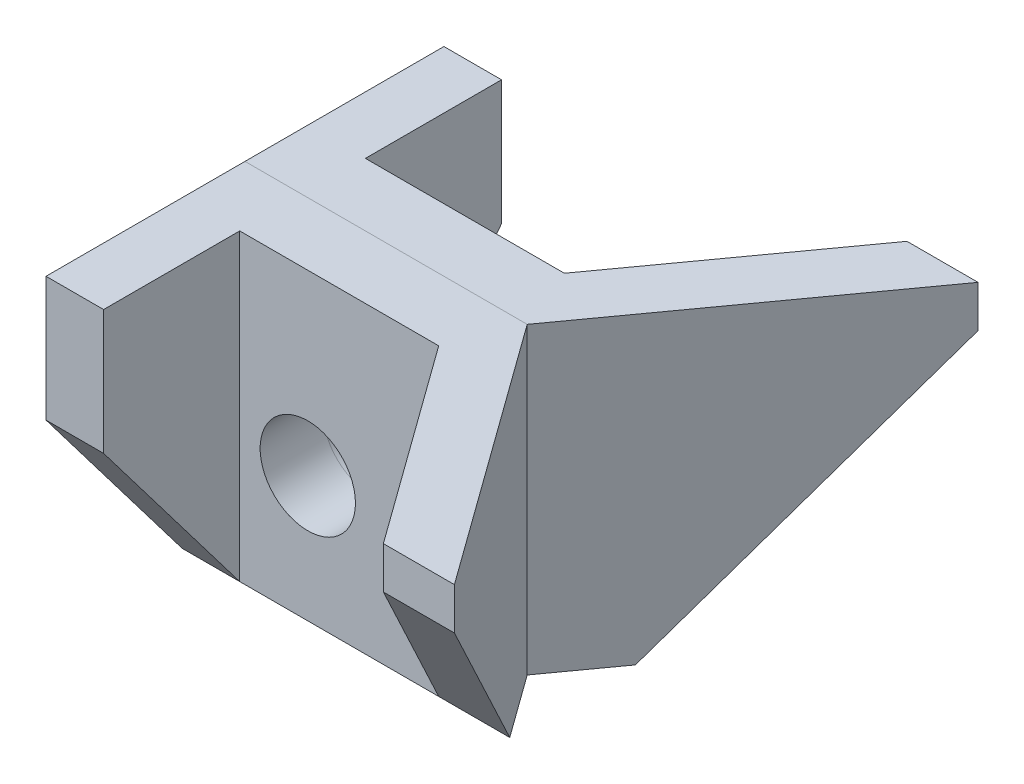
ISO-10303-21;
HEADER;
FILE_DESCRIPTION(('STEP AP214'),'2;1');
FILE_NAME('part.step','',(''),(''),'','','');
FILE_SCHEMA(('AUTOMOTIVE_DESIGN { 1 0 10303 214 1 1 1 1 }'));
ENDSEC;
DATA;
#1=APPLICATION_CONTEXT('core data for automotive mechanical design processes');
#2=APPLICATION_PROTOCOL_DEFINITION('international standard','automotive_design',2000,#1);
#3=PRODUCT_CONTEXT('',#1,'mechanical');
#4=PRODUCT('Part','Part','',(#3));
#5=PRODUCT_RELATED_PRODUCT_CATEGORY('part','',(#4));
#6=PRODUCT_DEFINITION_FORMATION('','',#4);
#7=PRODUCT_DEFINITION_CONTEXT('part definition',#1,'design');
#8=PRODUCT_DEFINITION('design','',#6,#7);
#9=PRODUCT_DEFINITION_SHAPE('','',#8);
#10=(LENGTH_UNIT() NAMED_UNIT(*) SI_UNIT(.MILLI.,.METRE.));
#11=(NAMED_UNIT(*) PLANE_ANGLE_UNIT() SI_UNIT($,.RADIAN.));
#12=(NAMED_UNIT(*) SI_UNIT($,.STERADIAN.) SOLID_ANGLE_UNIT());
#13=UNCERTAINTY_MEASURE_WITH_UNIT(LENGTH_MEASURE(1.E-05),#10,'distance_accuracy_value','');
#14=(GEOMETRIC_REPRESENTATION_CONTEXT(3) GLOBAL_UNCERTAINTY_ASSIGNED_CONTEXT((#13)) GLOBAL_UNIT_ASSIGNED_CONTEXT((#10,
#11,#12)) REPRESENTATION_CONTEXT('',''));
#15=CARTESIAN_POINT('',(0.,0.,0.));
#16=DIRECTION('',(0.,0.,1.));
#17=DIRECTION('',(1.,0.,0.));
#18=AXIS2_PLACEMENT_3D('',#15,#16,#17);
#19=CARTESIAN_POINT('',(0.,-12.,25.));
#20=DIRECTION('',(0.,-1.,0.));
#21=DIRECTION('',(1.,0.,0.));
#22=AXIS2_PLACEMENT_3D('',#19,#20,#21);
#23=PLANE('',#22);
#24=DIRECTION('',(0.,0.,-1.));
#25=VECTOR('',#24,1.);
#26=CARTESIAN_POINT('',(-12.,-12.,25.));
#27=LINE('',#26,#25);
#28=CARTESIAN_POINT('',(-12.,-12.,6.));
#29=VERTEX_POINT('',#28);
#30=CARTESIAN_POINT('',(-12.,-12.,0.));
#31=VERTEX_POINT('',#30);
#32=EDGE_CURVE('E13',#29,#31,#27,.T.);
#33=ORIENTED_EDGE('',*,*,#32,.T.);
#34=DIRECTION('',(1.,0.,0.));
#35=VECTOR('',#34,1.);
#36=CARTESIAN_POINT('',(0.,-12.,0.));
#37=LINE('',#36,#35);
#38=CARTESIAN_POINT('',(14.9519339128112,-12.,0.));
#39=VERTEX_POINT('',#38);
#40=EDGE_CURVE('E172',#31,#39,#37,.T.);
#41=ORIENTED_EDGE('',*,*,#40,.T.);
#42=DIRECTION('',(-0.585330910525227,0.,-0.810794502438015));
#43=VECTOR('',#42,1.);
#44=CARTESIAN_POINT('',(9.82921782204009,-12.,-7.09593491350215));
#45=LINE('',#44,#43);
#46=CARTESIAN_POINT('',(19.2834697737365,-12.,6.));
#47=VERTEX_POINT('',#46);
#48=EDGE_CURVE('E153',#47,#39,#45,.T.);
#49=ORIENTED_EDGE('',*,*,#48,.F.);
#50=DIRECTION('',(1.,0.,0.));
#51=VECTOR('',#50,1.);
#52=CARTESIAN_POINT('',(-43.4006369362152,-12.,6.));
#53=LINE('',#52,#51);
#54=CARTESIAN_POINT('',(12.5,-12.,6.));
#55=VERTEX_POINT('',#54);
#56=EDGE_CURVE('E162',#55,#47,#53,.T.);
#57=ORIENTED_EDGE('',*,*,#56,.F.);
#58=DIRECTION('',(1.,0.,0.));
#59=VECTOR('',#58,1.);
#60=CARTESIAN_POINT('',(0.,-12.,6.));
#61=LINE('',#60,#59);
#62=CARTESIAN_POINT('',(-6.49999999999999,-12.,6.));
#63=VERTEX_POINT('',#62);
#64=EDGE_CURVE('E228',#63,#55,#61,.T.);
#65=ORIENTED_EDGE('',*,*,#64,.F.);
#66=EDGE_CURVE('E168',#29,#63,#53,.T.);
#67=ORIENTED_EDGE('',*,*,#66,.F.);
#68=EDGE_LOOP('',(#33,#41,#49,#57,#65,#67));
#69=FACE_BOUND('',#68,.T.);
#70=ADVANCED_FACE('F77',(#69),#23,.T.);
#71=CARTESIAN_POINT('',(-12.,-12.,25.));
#72=DIRECTION('',(-1.,0.,0.));
#73=DIRECTION('',(0.,0.,-1.));
#74=AXIS2_PLACEMENT_3D('',#71,#72,#73);
#75=PLANE('',#74);
#76=DIRECTION('',(0.,1.,0.));
#77=VECTOR('',#76,1.);
#78=CARTESIAN_POINT('',(-12.,-12.,19.));
#79=LINE('',#78,#77);
#80=CARTESIAN_POINT('',(-12.,5.10526315789474,19.));
#81=VERTEX_POINT('',#80);
#82=CARTESIAN_POINT('',(-12.,17.,19.));
#83=VERTEX_POINT('',#82);
#84=EDGE_CURVE('E203',#81,#83,#79,.T.);
#85=ORIENTED_EDGE('',*,*,#84,.T.);
#86=DIRECTION('',(0.,0.,-1.));
#87=VECTOR('',#86,1.);
#88=CARTESIAN_POINT('',(-12.,17.,25.));
#89=LINE('',#88,#87);
#90=CARTESIAN_POINT('',(-12.,17.,0.));
#91=VERTEX_POINT('',#90);
#92=EDGE_CURVE('E86',#83,#91,#89,.T.);
#93=ORIENTED_EDGE('',*,*,#92,.T.);
#94=DIRECTION('',(0.,-1.,0.));
#95=VECTOR('',#94,1.);
#96=CARTESIAN_POINT('',(-12.,-12.,0.));
#97=LINE('',#96,#95);
#98=EDGE_CURVE('E193',#91,#31,#97,.T.);
#99=ORIENTED_EDGE('',*,*,#98,.T.);
#100=ORIENTED_EDGE('',*,*,#32,.F.);
#101=DIRECTION('',(0.,0.796162194123103,0.605083267533558));
#102=VECTOR('',#101,1.);
#103=CARTESIAN_POINT('',(-12.,-7.28397565922921,9.5841784989858));
#104=LINE('',#103,#102);
#105=EDGE_CURVE('E158',#29,#81,#104,.T.);
#106=ORIENTED_EDGE('',*,*,#105,.T.);
#107=EDGE_LOOP('',(#85,#93,#99,#100,#106));
#108=FACE_BOUND('',#107,.T.);
#109=ADVANCED_FACE('F199',(#108),#75,.T.);
#110=CARTESIAN_POINT('',(0.,0.,25.));
#111=DIRECTION('',(0.,0.,-1.));
#112=DIRECTION('',(1.,0.,0.));
#113=AXIS2_PLACEMENT_3D('',#110,#111,#112);
#114=PLANE('',#113);
#115=DIRECTION('',(1.,0.,0.));
#116=VECTOR('',#115,1.);
#117=CARTESIAN_POINT('',(-43.4006369362152,13.,25.));
#118=LINE('',#117,#116);
#119=CARTESIAN_POINT('',(26.2165302262635,13.,25.));
#120=VERTEX_POINT('',#119);
#121=CARTESIAN_POINT('',(33.,13.,25.));
#122=VERTEX_POINT('',#121);
#123=EDGE_CURVE('E169',#120,#122,#118,.T.);
#124=ORIENTED_EDGE('',*,*,#123,.T.);
#125=DIRECTION('',(0.,1.,0.));
#126=VECTOR('',#125,1.);
#127=CARTESIAN_POINT('',(33.,-12.,25.));
#128=LINE('',#127,#126);
#129=CARTESIAN_POINT('',(33.,17.,25.));
#130=VERTEX_POINT('',#129);
#131=EDGE_CURVE('E156',#122,#130,#128,.T.);
#132=ORIENTED_EDGE('',*,*,#131,.T.);
#133=DIRECTION('',(-1.,0.,0.));
#134=VECTOR('',#133,1.);
#135=CARTESIAN_POINT('',(33.,17.,25.));
#136=LINE('',#135,#134);
#137=CARTESIAN_POINT('',(26.2165302262635,17.,25.));
#138=VERTEX_POINT('',#137);
#139=EDGE_CURVE('E189',#130,#138,#136,.T.);
#140=ORIENTED_EDGE('',*,*,#139,.T.);
#141=DIRECTION('',(0.,1.,0.));
#142=VECTOR('',#141,1.);
#143=CARTESIAN_POINT('',(26.2165302262635,-12.,25.));
#144=LINE('',#143,#142);
#145=EDGE_CURVE('E219',#120,#138,#144,.T.);
#146=ORIENTED_EDGE('',*,*,#145,.F.);
#147=EDGE_LOOP('',(#124,#132,#140,#146));
#148=FACE_BOUND('',#147,.T.);
#149=ADVANCED_FACE('F242',(#148),#114,.F.);
#150=CARTESIAN_POINT('',(-6.49999999999999,-12.,0.));
#151=DIRECTION('',(-1.,0.,0.));
#152=DIRECTION('',(0.,-1.,0.));
#153=AXIS2_PLACEMENT_3D('',#150,#151,#152);
#154=PLANE('',#153);
#155=DIRECTION('',(0.,-0.796162194123103,-0.605083267533558));
#156=VECTOR('',#155,1.);
#157=CARTESIAN_POINT('',(-6.49999999999999,-14.8904665314402,3.80324543610548));
#158=LINE('',#157,#156);
#159=CARTESIAN_POINT('',(-6.49999999999999,5.10526315789474,19.));
#160=VERTEX_POINT('',#159);
#161=EDGE_CURVE('E234',#160,#63,#158,.T.);
#162=ORIENTED_EDGE('',*,*,#161,.T.);
#163=DIRECTION('',(0.,1.,0.));
#164=VECTOR('',#163,1.);
#165=CARTESIAN_POINT('',(-6.49999999999999,-12.,6.));
#166=LINE('',#165,#164);
#167=CARTESIAN_POINT('',(-6.5,17.,6.));
#168=VERTEX_POINT('',#167);
#169=EDGE_CURVE('E178',#63,#168,#166,.T.);
#170=ORIENTED_EDGE('',*,*,#169,.T.);
#171=DIRECTION('',(0.,0.,-1.));
#172=VECTOR('',#171,1.);
#173=CARTESIAN_POINT('',(-6.5,17.,0.));
#174=LINE('',#173,#172);
#175=CARTESIAN_POINT('',(-6.5,17.,19.));
#176=VERTEX_POINT('',#175);
#177=EDGE_CURVE('E226',#176,#168,#174,.T.);
#178=ORIENTED_EDGE('',*,*,#177,.F.);
#179=DIRECTION('',(0.,1.,0.));
#180=VECTOR('',#179,1.);
#181=CARTESIAN_POINT('',(-6.49999999999999,-12.,19.));
#182=LINE('',#181,#180);
#183=EDGE_CURVE('E218',#160,#176,#182,.T.);
#184=ORIENTED_EDGE('',*,*,#183,.F.);
#185=EDGE_LOOP('',(#162,#170,#178,#184));
#186=FACE_BOUND('',#185,.T.);
#187=ADVANCED_FACE('F252',(#186),#154,.F.);
#188=CARTESIAN_POINT('',(0.,-12.,19.));
#189=DIRECTION('',(0.,0.,-1.));
#190=DIRECTION('',(1.,0.,0.));
#191=AXIS2_PLACEMENT_3D('',#188,#189,#190);
#192=PLANE('',#191);
#193=DIRECTION('',(1.,0.,0.));
#194=VECTOR('',#193,1.);
#195=CARTESIAN_POINT('',(0.,5.10526315789474,19.));
#196=LINE('',#195,#194);
#197=EDGE_CURVE('E94',#81,#160,#196,.T.);
#198=ORIENTED_EDGE('',*,*,#197,.T.);
#199=ORIENTED_EDGE('',*,*,#183,.T.);
#200=DIRECTION('',(1.,0.,0.));
#201=VECTOR('',#200,1.);
#202=CARTESIAN_POINT('',(0.,17.,19.));
#203=LINE('',#202,#201);
#204=EDGE_CURVE('E206',#83,#176,#203,.T.);
#205=ORIENTED_EDGE('',*,*,#204,.F.);
#206=ORIENTED_EDGE('',*,*,#84,.F.);
#207=EDGE_LOOP('',(#198,#199,#205,#206));
#208=FACE_BOUND('',#207,.T.);
#209=ADVANCED_FACE('F216',(#208),#192,.F.);
#210=CARTESIAN_POINT('',(5.36984805863102,-12.,-3.8766149056134));
#211=DIRECTION('',(0.810794502438015,0.,-0.585330910525227));
#212=DIRECTION('',(0.585330910525227,0.,0.810794502438015));
#213=AXIS2_PLACEMENT_3D('',#210,#211,#212);
#214=PLANE('',#213);
#215=DIRECTION('',(0.400298286387528,0.72959101132782,0.554489168609143));
#216=VECTOR('',#215,1.);
#217=CARTESIAN_POINT('',(9.16524963985201,-18.0779772747536,1.38073727118729));
#218=LINE('',#217,#216);
#219=EDGE_CURVE('E164',#55,#120,#218,.T.);
#220=ORIENTED_EDGE('',*,*,#219,.T.);
#221=ORIENTED_EDGE('',*,*,#145,.T.);
#222=DIRECTION('',(0.585330910525227,0.,0.810794502438015));
#223=VECTOR('',#222,1.);
#224=CARTESIAN_POINT('',(5.36984805863101,17.,-3.8766149056134));
#225=LINE('',#224,#223);
#226=CARTESIAN_POINT('',(12.5,17.,6.));
#227=VERTEX_POINT('',#226);
#228=EDGE_CURVE('E230',#227,#138,#225,.T.);
#229=ORIENTED_EDGE('',*,*,#228,.F.);
#230=DIRECTION('',(0.,1.,0.));
#231=VECTOR('',#230,1.);
#232=CARTESIAN_POINT('',(12.5,-12.,6.));
#233=LINE('',#232,#231);
#234=EDGE_CURVE('E181',#55,#227,#233,.T.);
#235=ORIENTED_EDGE('',*,*,#234,.F.);
#236=EDGE_LOOP('',(#220,#221,#229,#235));
#237=FACE_BOUND('',#236,.T.);
#238=ADVANCED_FACE('F245',(#237),#214,.F.);
#239=CARTESIAN_POINT('',(9.82921782204009,-12.,-7.09593491350215));
#240=DIRECTION('',(-0.810794502438015,0.,0.585330910525227));
#241=DIRECTION('',(-0.585330910525227,0.,-0.810794502438015));
#242=AXIS2_PLACEMENT_3D('',#239,#240,#241);
#243=PLANE('',#242);
#244=DIRECTION('',(-0.400298286387528,-0.72959101132782,-0.554489168609143));
#245=VECTOR('',#244,1.);
#246=CARTESIAN_POINT('',(28.1739913433061,4.20402795552962,18.3150612462025));
#247=LINE('',#246,#245);
#248=EDGE_CURVE('E102',#122,#47,#247,.T.);
#249=ORIENTED_EDGE('',*,*,#248,.T.);
#250=ORIENTED_EDGE('',*,*,#48,.T.);
#251=DIRECTION('',(0.,1.,0.));
#252=VECTOR('',#251,1.);
#253=CARTESIAN_POINT('',(14.9519339128112,-12.,0.));
#254=LINE('',#253,#252);
#255=CARTESIAN_POINT('',(14.9519339128112,17.,0.));
#256=VERTEX_POINT('',#255);
#257=EDGE_CURVE('E173',#39,#256,#254,.T.);
#258=ORIENTED_EDGE('',*,*,#257,.T.);
#259=DIRECTION('',(-0.585330910525227,0.,-0.810794502438015));
#260=VECTOR('',#259,1.);
#261=CARTESIAN_POINT('',(9.82921782204009,17.,-7.09593491350215));
#262=LINE('',#261,#260);
#263=EDGE_CURVE('E174',#130,#256,#262,.T.);
#264=ORIENTED_EDGE('',*,*,#263,.F.);
#265=ORIENTED_EDGE('',*,*,#131,.F.);
#266=EDGE_LOOP('',(#249,#250,#258,#264,#265));
#267=FACE_BOUND('',#266,.T.);
#268=ADVANCED_FACE('F150',(#267),#243,.F.);
#269=CARTESIAN_POINT('',(33.,17.,25.));
#270=DIRECTION('',(0.,1.,0.));
#271=DIRECTION('',(-1.,0.,0.));
#272=AXIS2_PLACEMENT_3D('',#269,#270,#271);
#273=PLANE('',#272);
#274=ORIENTED_EDGE('',*,*,#204,.T.);
#275=ORIENTED_EDGE('',*,*,#177,.T.);
#276=DIRECTION('',(1.,0.,0.));
#277=VECTOR('',#276,1.);
#278=CARTESIAN_POINT('',(0.,17.,6.));
#279=LINE('',#278,#277);
#280=EDGE_CURVE('E232',#168,#227,#279,.T.);
#281=ORIENTED_EDGE('',*,*,#280,.T.);
#282=ORIENTED_EDGE('',*,*,#228,.T.);
#283=ORIENTED_EDGE('',*,*,#139,.F.);
#284=ORIENTED_EDGE('',*,*,#263,.T.);
#285=DIRECTION('',(-1.,0.,0.));
#286=VECTOR('',#285,1.);
#287=CARTESIAN_POINT('',(33.,17.,0.));
#288=LINE('',#287,#286);
#289=EDGE_CURVE('E187',#256,#91,#288,.T.);
#290=ORIENTED_EDGE('',*,*,#289,.T.);
#291=ORIENTED_EDGE('',*,*,#92,.F.);
#292=EDGE_LOOP('',(#274,#275,#281,#282,#283,#284,#290,#291));
#293=FACE_BOUND('',#292,.T.);
#294=ADVANCED_FACE('F79',(#293),#273,.T.);
#295=CARTESIAN_POINT('',(0.,0.,0.));
#296=DIRECTION('',(0.,0.,-1.));
#297=DIRECTION('',(1.,0.,0.));
#298=AXIS2_PLACEMENT_3D('',#295,#296,#297);
#299=PLANE('',#298);
#300=ORIENTED_EDGE('',*,*,#257,.F.);
#301=ORIENTED_EDGE('',*,*,#40,.F.);
#302=ORIENTED_EDGE('',*,*,#98,.F.);
#303=ORIENTED_EDGE('',*,*,#289,.F.);
#304=EDGE_LOOP('',(#300,#301,#302,#303));
#305=FACE_BOUND('',#304,.T.);
#306=CARTESIAN_POINT('',(0.,0.,0.));
#307=DIRECTION('',(0.,0.,1.));
#308=DIRECTION('',(1.,0.,0.));
#309=AXIS2_PLACEMENT_3D('',#306,#307,#308);
#310=CIRCLE('',#309,4.55);
#311=CARTESIAN_POINT('',(4.55,0.,0.));
#312=VERTEX_POINT('',#311);
#313=EDGE_CURVE('E184',#312,#312,#310,.T.);
#314=ORIENTED_EDGE('',*,*,#313,.T.);
#315=EDGE_LOOP('',(#314));
#316=FACE_BOUND('',#315,.T.);
#317=ADVANCED_FACE('F210',(#305,#316),#299,.T.);
#318=CARTESIAN_POINT('',(0.,0.,25.));
#319=DIRECTION('',(0.,0.,-1.));
#320=DIRECTION('',(1.,0.,0.));
#321=AXIS2_PLACEMENT_3D('',#318,#319,#320);
#322=CYLINDRICAL_SURFACE('',#321,4.55);
#323=CARTESIAN_POINT('',(0.,0.,6.));
#324=DIRECTION('',(0.,0.,1.));
#325=DIRECTION('',(1.,0.,0.));
#326=AXIS2_PLACEMENT_3D('',#323,#324,#325);
#327=CIRCLE('',#326,4.55);
#328=CARTESIAN_POINT('',(4.55,0.,6.));
#329=VERTEX_POINT('',#328);
#330=EDGE_CURVE('E81',#329,#329,#327,.F.);
#331=ORIENTED_EDGE('',*,*,#330,.F.);
#332=EDGE_LOOP('',(#331));
#333=FACE_BOUND('',#332,.T.);
#334=ORIENTED_EDGE('',*,*,#313,.F.);
#335=EDGE_LOOP('',(#334));
#336=FACE_BOUND('',#335,.T.);
#337=ADVANCED_FACE('F268',(#333,#336),#322,.F.);
#338=CARTESIAN_POINT('',(0.,-12.,6.));
#339=DIRECTION('',(0.,0.,-1.));
#340=DIRECTION('',(1.,0.,0.));
#341=AXIS2_PLACEMENT_3D('',#338,#339,#340);
#342=PLANE('',#341);
#343=ORIENTED_EDGE('',*,*,#280,.F.);
#344=ORIENTED_EDGE('',*,*,#169,.F.);
#345=ORIENTED_EDGE('',*,*,#64,.T.);
#346=ORIENTED_EDGE('',*,*,#234,.T.);
#347=EDGE_LOOP('',(#343,#344,#345,#346));
#348=FACE_BOUND('',#347,.T.);
#349=ORIENTED_EDGE('',*,*,#330,.T.);
#350=EDGE_LOOP('',(#349));
#351=FACE_BOUND('',#350,.T.);
#352=ADVANCED_FACE('F248',(#348,#351),#342,.F.);
#353=CARTESIAN_POINT('',(-43.4006369362152,-7.28397565922922,9.58417849898581));
#354=DIRECTION('',(0.,-0.605083267533558,0.796162194123103));
#355=DIRECTION('',(0.,0.796162194123103,0.605083267533558));
#356=AXIS2_PLACEMENT_3D('',#353,#354,#355);
#357=PLANE('',#356);
#358=ORIENTED_EDGE('',*,*,#219,.F.);
#359=ORIENTED_EDGE('',*,*,#56,.T.);
#360=ORIENTED_EDGE('',*,*,#248,.F.);
#361=ORIENTED_EDGE('',*,*,#123,.F.);
#362=EDGE_LOOP('',(#358,#359,#360,#361));
#363=FACE_BOUND('',#362,.T.);
#364=ADVANCED_FACE('F163',(#363),#357,.T.);
#365=ORIENTED_EDGE('',*,*,#161,.F.);
#366=ORIENTED_EDGE('',*,*,#197,.F.);
#367=ORIENTED_EDGE('',*,*,#105,.F.);
#368=ORIENTED_EDGE('',*,*,#66,.T.);
#369=EDGE_LOOP('',(#365,#366,#367,#368));
#370=FACE_BOUND('',#369,.T.);
#371=ADVANCED_FACE('F253',(#370),#357,.T.);
#372=CLOSED_SHELL('',(#70,#109,#149,#187,#209,#238,#268,#294,#317,#337,#352,#364,#371));
#373=MANIFOLD_SOLID_BREP('B2_NOT_SHOWN',#372);
#374=CARTESIAN_POINT('',(0.,-12.,-25.));
#375=DIRECTION('',(0.,-1.,0.));
#376=DIRECTION('',(1.,0.,0.));
#377=AXIS2_PLACEMENT_3D('',#374,#375,#376);
#378=PLANE('',#377);
#379=DIRECTION('',(0.,0.,1.));
#380=VECTOR('',#379,1.);
#381=CARTESIAN_POINT('',(-12.,-12.,-25.));
#382=LINE('',#381,#380);
#383=CARTESIAN_POINT('',(-12.,-12.,-6.));
#384=VERTEX_POINT('',#383);
#385=CARTESIAN_POINT('',(-12.,-12.,0.));
#386=VERTEX_POINT('',#385);
#387=EDGE_CURVE('E75',#384,#386,#382,.T.);
#388=ORIENTED_EDGE('',*,*,#387,.F.);
#389=DIRECTION('',(1.,0.,0.));
#390=VECTOR('',#389,1.);
#391=CARTESIAN_POINT('',(-43.4006369362152,-12.,-6.));
#392=LINE('',#391,#390);
#393=CARTESIAN_POINT('',(-6.49999999999999,-12.,-6.));
#394=VERTEX_POINT('',#393);
#395=EDGE_CURVE('E479',#384,#394,#392,.T.);
#396=ORIENTED_EDGE('',*,*,#395,.T.);
#397=DIRECTION('',(1.,0.,0.));
#398=VECTOR('',#397,1.);
#399=CARTESIAN_POINT('',(0.,-12.,-6.));
#400=LINE('',#399,#398);
#401=CARTESIAN_POINT('',(12.5,-12.,-6.));
#402=VERTEX_POINT('',#401);
#403=EDGE_CURVE('E478',#394,#402,#400,.T.);
#404=ORIENTED_EDGE('',*,*,#403,.T.);
#405=CARTESIAN_POINT('',(19.2834697737365,-12.,-6.));
#406=VERTEX_POINT('',#405);
#407=EDGE_CURVE('E464',#402,#406,#392,.T.);
#408=ORIENTED_EDGE('',*,*,#407,.T.);
#409=DIRECTION('',(-0.585330910525227,0.,0.810794502438015));
#410=VECTOR('',#409,1.);
#411=CARTESIAN_POINT('',(9.82921782204009,-12.,7.09593491350215));
#412=LINE('',#411,#410);
#413=CARTESIAN_POINT('',(14.9519339128112,-12.,0.));
#414=VERTEX_POINT('',#413);
#415=EDGE_CURVE('E474',#406,#414,#412,.T.);
#416=ORIENTED_EDGE('',*,*,#415,.T.);
#417=DIRECTION('',(1.,0.,0.));
#418=VECTOR('',#417,1.);
#419=CARTESIAN_POINT('',(0.,-12.,0.));
#420=LINE('',#419,#418);
#421=EDGE_CURVE('E501',#386,#414,#420,.T.);
#422=ORIENTED_EDGE('',*,*,#421,.F.);
#423=EDGE_LOOP('',(#388,#396,#404,#408,#416,#422));
#424=FACE_BOUND('',#423,.T.);
#425=ADVANCED_FACE('F392',(#424),#378,.T.);
#426=CARTESIAN_POINT('',(-12.,-12.,-25.));
#427=DIRECTION('',(-1.,0.,0.));
#428=DIRECTION('',(0.,0.,1.));
#429=AXIS2_PLACEMENT_3D('',#426,#427,#428);
#430=PLANE('',#429);
#431=DIRECTION('',(0.,1.,0.));
#432=VECTOR('',#431,1.);
#433=CARTESIAN_POINT('',(-12.,-12.,-19.));
#434=LINE('',#433,#432);
#435=CARTESIAN_POINT('',(-12.,5.10526315789474,-19.));
#436=VERTEX_POINT('',#435);
#437=CARTESIAN_POINT('',(-12.,17.,-19.));
#438=VERTEX_POINT('',#437);
#439=EDGE_CURVE('E554',#436,#438,#434,.T.);
#440=ORIENTED_EDGE('',*,*,#439,.F.);
#441=DIRECTION('',(0.,0.796162194123103,-0.605083267533558));
#442=VECTOR('',#441,1.);
#443=CARTESIAN_POINT('',(-12.,-7.28397565922921,-9.5841784989858));
#444=LINE('',#443,#442);
#445=EDGE_CURVE('E409',#384,#436,#444,.T.);
#446=ORIENTED_EDGE('',*,*,#445,.F.);
#447=ORIENTED_EDGE('',*,*,#387,.T.);
#448=DIRECTION('',(0.,-1.,0.));
#449=VECTOR('',#448,1.);
#450=CARTESIAN_POINT('',(-12.,-12.,0.));
#451=LINE('',#450,#449);
#452=CARTESIAN_POINT('',(-12.,17.,0.));
#453=VERTEX_POINT('',#452);
#454=EDGE_CURVE('E506',#453,#386,#451,.T.);
#455=ORIENTED_EDGE('',*,*,#454,.F.);
#456=DIRECTION('',(0.,0.,1.));
#457=VECTOR('',#456,1.);
#458=CARTESIAN_POINT('',(-12.,17.,-25.));
#459=LINE('',#458,#457);
#460=EDGE_CURVE('E401',#438,#453,#459,.T.);
#461=ORIENTED_EDGE('',*,*,#460,.F.);
#462=EDGE_LOOP('',(#440,#446,#447,#455,#461));
#463=FACE_BOUND('',#462,.T.);
#464=ADVANCED_FACE('F523',(#463),#430,.T.);
#465=CARTESIAN_POINT('',(0.,0.,-25.));
#466=DIRECTION('',(0.,0.,1.));
#467=DIRECTION('',(1.,0.,0.));
#468=AXIS2_PLACEMENT_3D('',#465,#466,#467);
#469=PLANE('',#468);
#470=DIRECTION('',(1.,0.,0.));
#471=VECTOR('',#470,1.);
#472=CARTESIAN_POINT('',(-43.4006369362152,13.,-25.));
#473=LINE('',#472,#471);
#474=CARTESIAN_POINT('',(26.2165302262635,13.,-25.));
#475=VERTEX_POINT('',#474);
#476=CARTESIAN_POINT('',(33.,13.,-25.));
#477=VERTEX_POINT('',#476);
#478=EDGE_CURVE('E417',#475,#477,#473,.T.);
#479=ORIENTED_EDGE('',*,*,#478,.F.);
#480=DIRECTION('',(0.,1.,0.));
#481=VECTOR('',#480,1.);
#482=CARTESIAN_POINT('',(26.2165302262635,-12.,-25.));
#483=LINE('',#482,#481);
#484=CARTESIAN_POINT('',(26.2165302262635,17.,-25.));
#485=VERTEX_POINT('',#484);
#486=EDGE_CURVE('E542',#475,#485,#483,.T.);
#487=ORIENTED_EDGE('',*,*,#486,.T.);
#488=DIRECTION('',(-1.,0.,0.));
#489=VECTOR('',#488,1.);
#490=CARTESIAN_POINT('',(33.,17.,-25.));
#491=LINE('',#490,#489);
#492=CARTESIAN_POINT('',(33.,17.,-25.));
#493=VERTEX_POINT('',#492);
#494=EDGE_CURVE('E500',#493,#485,#491,.T.);
#495=ORIENTED_EDGE('',*,*,#494,.F.);
#496=DIRECTION('',(0.,1.,0.));
#497=VECTOR('',#496,1.);
#498=CARTESIAN_POINT('',(33.,-12.,-25.));
#499=LINE('',#498,#497);
#500=EDGE_CURVE('E498',#477,#493,#499,.T.);
#501=ORIENTED_EDGE('',*,*,#500,.F.);
#502=EDGE_LOOP('',(#479,#487,#495,#501));
#503=FACE_BOUND('',#502,.T.);
#504=ADVANCED_FACE('F558',(#503),#469,.F.);
#505=CARTESIAN_POINT('',(-6.49999999999999,-12.,0.));
#506=DIRECTION('',(-1.,0.,0.));
#507=DIRECTION('',(0.,-1.,0.));
#508=AXIS2_PLACEMENT_3D('',#505,#506,#507);
#509=PLANE('',#508);
#510=DIRECTION('',(0.,-0.796162194123103,0.605083267533558));
#511=VECTOR('',#510,1.);
#512=CARTESIAN_POINT('',(-6.49999999999999,-14.8904665314402,-3.80324543610548));
#513=LINE('',#512,#511);
#514=CARTESIAN_POINT('',(-6.49999999999999,5.10526315789474,-19.));
#515=VERTEX_POINT('',#514);
#516=EDGE_CURVE('E530',#515,#394,#513,.T.);
#517=ORIENTED_EDGE('',*,*,#516,.F.);
#518=DIRECTION('',(0.,1.,0.));
#519=VECTOR('',#518,1.);
#520=CARTESIAN_POINT('',(-6.49999999999999,-12.,-19.));
#521=LINE('',#520,#519);
#522=CARTESIAN_POINT('',(-6.5,17.,-19.));
#523=VERTEX_POINT('',#522);
#524=EDGE_CURVE('E536',#515,#523,#521,.T.);
#525=ORIENTED_EDGE('',*,*,#524,.T.);
#526=DIRECTION('',(0.,0.,1.));
#527=VECTOR('',#526,1.);
#528=CARTESIAN_POINT('',(-6.5,17.,0.));
#529=LINE('',#528,#527);
#530=CARTESIAN_POINT('',(-6.5,17.,-6.));
#531=VERTEX_POINT('',#530);
#532=EDGE_CURVE('E532',#523,#531,#529,.T.);
#533=ORIENTED_EDGE('',*,*,#532,.T.);
#534=DIRECTION('',(0.,1.,0.));
#535=VECTOR('',#534,1.);
#536=CARTESIAN_POINT('',(-6.49999999999999,-12.,-6.));
#537=LINE('',#536,#535);
#538=EDGE_CURVE('E488',#394,#531,#537,.T.);
#539=ORIENTED_EDGE('',*,*,#538,.F.);
#540=EDGE_LOOP('',(#517,#525,#533,#539));
#541=FACE_BOUND('',#540,.T.);
#542=ADVANCED_FACE('F529',(#541),#509,.F.);
#543=CARTESIAN_POINT('',(0.,-12.,-19.));
#544=DIRECTION('',(0.,0.,1.));
#545=DIRECTION('',(1.,0.,0.));
#546=AXIS2_PLACEMENT_3D('',#543,#544,#545);
#547=PLANE('',#546);
#548=DIRECTION('',(1.,0.,0.));
#549=VECTOR('',#548,1.);
#550=CARTESIAN_POINT('',(0.,5.10526315789474,-19.));
#551=LINE('',#550,#549);
#552=EDGE_CURVE('E562',#436,#515,#551,.T.);
#553=ORIENTED_EDGE('',*,*,#552,.F.);
#554=ORIENTED_EDGE('',*,*,#439,.T.);
#555=DIRECTION('',(1.,0.,0.));
#556=VECTOR('',#555,1.);
#557=CARTESIAN_POINT('',(0.,17.,-19.));
#558=LINE('',#557,#556);
#559=EDGE_CURVE('E516',#438,#523,#558,.T.);
#560=ORIENTED_EDGE('',*,*,#559,.T.);
#561=ORIENTED_EDGE('',*,*,#524,.F.);
#562=EDGE_LOOP('',(#553,#554,#560,#561));
#563=FACE_BOUND('',#562,.T.);
#564=ADVANCED_FACE('F593',(#563),#547,.F.);
#565=CARTESIAN_POINT('',(5.36984805863102,-12.,3.8766149056134));
#566=DIRECTION('',(0.810794502438015,0.,0.585330910525227));
#567=DIRECTION('',(0.585330910525227,0.,-0.810794502438015));
#568=AXIS2_PLACEMENT_3D('',#565,#566,#567);
#569=PLANE('',#568);
#570=DIRECTION('',(0.400298286387528,0.72959101132782,-0.554489168609143));
#571=VECTOR('',#570,1.);
#572=CARTESIAN_POINT('',(9.16524963985201,-18.0779772747536,-1.38073727118729));
#573=LINE('',#572,#571);
#574=EDGE_CURVE('E525',#402,#475,#573,.T.);
#575=ORIENTED_EDGE('',*,*,#574,.F.);
#576=DIRECTION('',(0.,1.,0.));
#577=VECTOR('',#576,1.);
#578=CARTESIAN_POINT('',(12.5,-12.,-6.));
#579=LINE('',#578,#577);
#580=CARTESIAN_POINT('',(12.5,17.,-6.));
#581=VERTEX_POINT('',#580);
#582=EDGE_CURVE('E491',#402,#581,#579,.T.);
#583=ORIENTED_EDGE('',*,*,#582,.T.);
#584=DIRECTION('',(0.585330910525227,0.,-0.810794502438015));
#585=VECTOR('',#584,1.);
#586=CARTESIAN_POINT('',(5.36984805863101,17.,3.8766149056134));
#587=LINE('',#586,#585);
#588=EDGE_CURVE('E549',#581,#485,#587,.T.);
#589=ORIENTED_EDGE('',*,*,#588,.T.);
#590=ORIENTED_EDGE('',*,*,#486,.F.);
#591=EDGE_LOOP('',(#575,#583,#589,#590));
#592=FACE_BOUND('',#591,.T.);
#593=ADVANCED_FACE('F561',(#592),#569,.F.);
#594=CARTESIAN_POINT('',(9.82921782204009,-12.,7.09593491350215));
#595=DIRECTION('',(-0.810794502438015,0.,-0.585330910525227));
#596=DIRECTION('',(-0.585330910525227,0.,0.810794502438015));
#597=AXIS2_PLACEMENT_3D('',#594,#595,#596);
#598=PLANE('',#597);
#599=DIRECTION('',(-0.400298286387528,-0.72959101132782,0.554489168609143));
#600=VECTOR('',#599,1.);
#601=CARTESIAN_POINT('',(28.1739913433061,4.20402795552962,-18.3150612462025));
#602=LINE('',#601,#600);
#603=EDGE_CURVE('E461',#477,#406,#602,.T.);
#604=ORIENTED_EDGE('',*,*,#603,.F.);
#605=ORIENTED_EDGE('',*,*,#500,.T.);
#606=DIRECTION('',(-0.585330910525227,0.,0.810794502438015));
#607=VECTOR('',#606,1.);
#608=CARTESIAN_POINT('',(9.82921782204009,17.,7.09593491350215));
#609=LINE('',#608,#607);
#610=CARTESIAN_POINT('',(14.9519339128112,17.,0.));
#611=VERTEX_POINT('',#610);
#612=EDGE_CURVE('E485',#493,#611,#609,.T.);
#613=ORIENTED_EDGE('',*,*,#612,.T.);
#614=DIRECTION('',(0.,1.,0.));
#615=VECTOR('',#614,1.);
#616=CARTESIAN_POINT('',(14.9519339128112,-12.,0.));
#617=LINE('',#616,#615);
#618=EDGE_CURVE('E483',#414,#611,#617,.T.);
#619=ORIENTED_EDGE('',*,*,#618,.F.);
#620=ORIENTED_EDGE('',*,*,#415,.F.);
#621=EDGE_LOOP('',(#604,#605,#613,#619,#620));
#622=FACE_BOUND('',#621,.T.);
#623=ADVANCED_FACE('F481',(#622),#598,.F.);
#624=CARTESIAN_POINT('',(33.,17.,-25.));
#625=DIRECTION('',(0.,1.,0.));
#626=DIRECTION('',(-1.,0.,0.));
#627=AXIS2_PLACEMENT_3D('',#624,#625,#626);
#628=PLANE('',#627);
#629=ORIENTED_EDGE('',*,*,#559,.F.);
#630=ORIENTED_EDGE('',*,*,#460,.T.);
#631=DIRECTION('',(-1.,0.,0.));
#632=VECTOR('',#631,1.);
#633=CARTESIAN_POINT('',(33.,17.,0.));
#634=LINE('',#633,#632);
#635=EDGE_CURVE('E497',#611,#453,#634,.T.);
#636=ORIENTED_EDGE('',*,*,#635,.F.);
#637=ORIENTED_EDGE('',*,*,#612,.F.);
#638=ORIENTED_EDGE('',*,*,#494,.T.);
#639=ORIENTED_EDGE('',*,*,#588,.F.);
#640=DIRECTION('',(1.,0.,0.));
#641=VECTOR('',#640,1.);
#642=CARTESIAN_POINT('',(0.,17.,-6.));
#643=LINE('',#642,#641);
#644=EDGE_CURVE('E547',#531,#581,#643,.T.);
#645=ORIENTED_EDGE('',*,*,#644,.F.);
#646=ORIENTED_EDGE('',*,*,#532,.F.);
#647=EDGE_LOOP('',(#629,#630,#636,#637,#638,#639,#645,#646));
#648=FACE_BOUND('',#647,.T.);
#649=ADVANCED_FACE('F394',(#648),#628,.T.);
#650=CARTESIAN_POINT('',(0.,0.,0.));
#651=DIRECTION('',(0.,0.,1.));
#652=DIRECTION('',(1.,0.,0.));
#653=AXIS2_PLACEMENT_3D('',#650,#651,#652);
#654=PLANE('',#653);
#655=ORIENTED_EDGE('',*,*,#618,.T.);
#656=ORIENTED_EDGE('',*,*,#635,.T.);
#657=ORIENTED_EDGE('',*,*,#454,.T.);
#658=ORIENTED_EDGE('',*,*,#421,.T.);
#659=EDGE_LOOP('',(#655,#656,#657,#658));
#660=FACE_BOUND('',#659,.T.);
#661=CARTESIAN_POINT('',(0.,0.,0.));
#662=DIRECTION('',(0.,0.,1.));
#663=DIRECTION('',(1.,0.,0.));
#664=AXIS2_PLACEMENT_3D('',#661,#662,#663);
#665=CIRCLE('',#664,4.55);
#666=CARTESIAN_POINT('',(4.55,0.,0.));
#667=VERTEX_POINT('',#666);
#668=EDGE_CURVE('E494',#667,#667,#665,.T.);
#669=ORIENTED_EDGE('',*,*,#668,.F.);
#670=EDGE_LOOP('',(#669));
#671=FACE_BOUND('',#670,.T.);
#672=ADVANCED_FACE('F521',(#660,#671),#654,.T.);
#673=CARTESIAN_POINT('',(0.,0.,-25.));
#674=DIRECTION('',(0.,0.,1.));
#675=DIRECTION('',(1.,0.,0.));
#676=AXIS2_PLACEMENT_3D('',#673,#674,#675);
#677=CYLINDRICAL_SURFACE('',#676,4.55);
#678=CARTESIAN_POINT('',(0.,0.,-6.));
#679=DIRECTION('',(0.,0.,1.));
#680=DIRECTION('',(1.,0.,0.));
#681=AXIS2_PLACEMENT_3D('',#678,#679,#680);
#682=CIRCLE('',#681,4.55);
#683=CARTESIAN_POINT('',(4.55,0.,-6.));
#684=VERTEX_POINT('',#683);
#685=EDGE_CURVE('E396',#684,#684,#682,.F.);
#686=ORIENTED_EDGE('',*,*,#685,.T.);
#687=EDGE_LOOP('',(#686));
#688=FACE_BOUND('',#687,.T.);
#689=ORIENTED_EDGE('',*,*,#668,.T.);
#690=EDGE_LOOP('',(#689));
#691=FACE_BOUND('',#690,.T.);
#692=ADVANCED_FACE('F581',(#688,#691),#677,.F.);
#693=CARTESIAN_POINT('',(0.,-12.,-6.));
#694=DIRECTION('',(0.,0.,1.));
#695=DIRECTION('',(1.,0.,0.));
#696=AXIS2_PLACEMENT_3D('',#693,#694,#695);
#697=PLANE('',#696);
#698=ORIENTED_EDGE('',*,*,#644,.T.);
#699=ORIENTED_EDGE('',*,*,#582,.F.);
#700=ORIENTED_EDGE('',*,*,#403,.F.);
#701=ORIENTED_EDGE('',*,*,#538,.T.);
#702=EDGE_LOOP('',(#698,#699,#700,#701));
#703=FACE_BOUND('',#702,.T.);
#704=ORIENTED_EDGE('',*,*,#685,.F.);
#705=EDGE_LOOP('',(#704));
#706=FACE_BOUND('',#705,.T.);
#707=ADVANCED_FACE('F539',(#703,#706),#697,.F.);
#708=CARTESIAN_POINT('',(-43.4006369362152,-7.28397565922922,-9.58417849898581));
#709=DIRECTION('',(0.,-0.605083267533558,-0.796162194123103));
#710=DIRECTION('',(0.,0.796162194123103,-0.605083267533558));
#711=AXIS2_PLACEMENT_3D('',#708,#709,#710);
#712=PLANE('',#711);
#713=ORIENTED_EDGE('',*,*,#574,.T.);
#714=ORIENTED_EDGE('',*,*,#478,.T.);
#715=ORIENTED_EDGE('',*,*,#603,.T.);
#716=ORIENTED_EDGE('',*,*,#407,.F.);
#717=EDGE_LOOP('',(#713,#714,#715,#716));
#718=FACE_BOUND('',#717,.T.);
#719=ADVANCED_FACE('F463',(#718),#712,.T.);
#720=ORIENTED_EDGE('',*,*,#516,.T.);
#721=ORIENTED_EDGE('',*,*,#395,.F.);
#722=ORIENTED_EDGE('',*,*,#445,.T.);
#723=ORIENTED_EDGE('',*,*,#552,.T.);
#724=EDGE_LOOP('',(#720,#721,#722,#723));
#725=FACE_BOUND('',#724,.T.);
#726=ADVANCED_FACE('F566',(#725),#712,.T.);
#727=CLOSED_SHELL('',(#425,#464,#504,#542,#564,#593,#623,#649,#672,#692,#707,#719,#726));
#728=MANIFOLD_SOLID_BREP('B7',#727);
#729=ADVANCED_BREP_SHAPE_REPRESENTATION('',(#18,#373,#728),#14);
#730=SHAPE_DEFINITION_REPRESENTATION(#9,#729);
ENDSEC;
END-ISO-10303-21;
